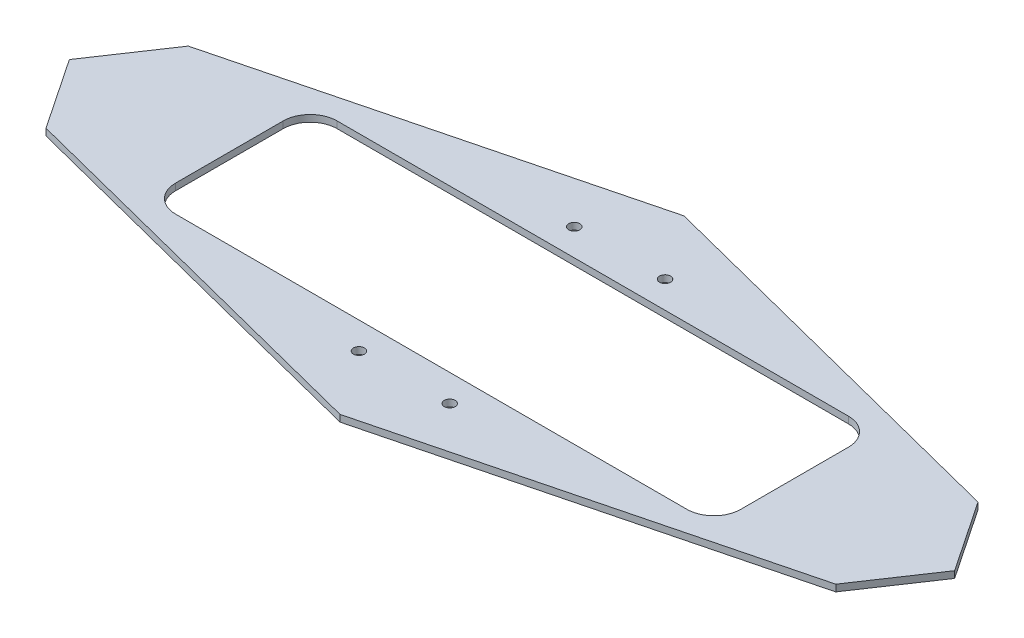
ISO-10303-21;
HEADER;
FILE_DESCRIPTION(('STEP AP214'),'2;1');
FILE_NAME('part.step','',(''),(''),'','','');
FILE_SCHEMA(('AUTOMOTIVE_DESIGN { 1 0 10303 214 1 1 1 1 }'));
ENDSEC;
DATA;
#1=APPLICATION_CONTEXT('core data for automotive mechanical design processes');
#2=APPLICATION_PROTOCOL_DEFINITION('international standard','automotive_design',2000,#1);
#3=PRODUCT_CONTEXT('',#1,'mechanical');
#4=PRODUCT('Part','Part','',(#3));
#5=PRODUCT_RELATED_PRODUCT_CATEGORY('part','',(#4));
#6=PRODUCT_DEFINITION_FORMATION('','',#4);
#7=PRODUCT_DEFINITION_CONTEXT('part definition',#1,'design');
#8=PRODUCT_DEFINITION('design','',#6,#7);
#9=PRODUCT_DEFINITION_SHAPE('','',#8);
#10=(LENGTH_UNIT() NAMED_UNIT(*) SI_UNIT(.MILLI.,.METRE.));
#11=(NAMED_UNIT(*) PLANE_ANGLE_UNIT() SI_UNIT($,.RADIAN.));
#12=(NAMED_UNIT(*) SI_UNIT($,.STERADIAN.) SOLID_ANGLE_UNIT());
#13=UNCERTAINTY_MEASURE_WITH_UNIT(LENGTH_MEASURE(1.E-05),#10,'distance_accuracy_value','');
#14=(GEOMETRIC_REPRESENTATION_CONTEXT(3) GLOBAL_UNCERTAINTY_ASSIGNED_CONTEXT((#13)) GLOBAL_UNIT_ASSIGNED_CONTEXT((#10,
#11,#12)) REPRESENTATION_CONTEXT('',''));
#15=CARTESIAN_POINT('',(0.,0.,0.));
#16=DIRECTION('',(0.,0.,1.));
#17=DIRECTION('',(1.,0.,0.));
#18=AXIS2_PLACEMENT_3D('',#15,#16,#17);
#19=CARTESIAN_POINT('',(-417.779308922507,3.175,0.));
#20=DIRECTION('',(0.830136035999272,0.,0.557560904059293));
#21=DIRECTION('',(0.557560904059293,0.,-0.830136035999272));
#22=AXIS2_PLACEMENT_3D('',#19,#20,#21);
#23=PLANE('',#22);
#24=DIRECTION('',(-0.557560904059293,0.,0.830136035999272));
#25=VECTOR('',#24,1.);
#26=CARTESIAN_POINT('',(-417.779308922507,-3.175,0.));
#27=LINE('',#26,#25);
#28=CARTESIAN_POINT('',(-372.691935384948,-3.175,-67.1292647486396));
#29=VERTEX_POINT('',#28);
#30=CARTESIAN_POINT('',(-417.779308922507,-3.175,0.));
#31=VERTEX_POINT('',#30);
#32=EDGE_CURVE('E204',#29,#31,#27,.T.);
#33=ORIENTED_EDGE('',*,*,#32,.T.);
#34=DIRECTION('',(0.,-1.,0.));
#35=VECTOR('',#34,1.);
#36=CARTESIAN_POINT('',(-417.779308922507,3.175,0.));
#37=LINE('',#36,#35);
#38=CARTESIAN_POINT('',(-417.779308922507,3.175,0.));
#39=VERTEX_POINT('',#38);
#40=EDGE_CURVE('E11',#39,#31,#37,.T.);
#41=ORIENTED_EDGE('',*,*,#40,.F.);
#42=DIRECTION('',(-0.557560904059293,0.,0.830136035999272));
#43=VECTOR('',#42,1.);
#44=CARTESIAN_POINT('',(-417.779308922507,3.175,0.));
#45=LINE('',#44,#43);
#46=CARTESIAN_POINT('',(-372.691935384948,3.175,-67.1292647486396));
#47=VERTEX_POINT('',#46);
#48=EDGE_CURVE('E215',#47,#39,#45,.T.);
#49=ORIENTED_EDGE('',*,*,#48,.F.);
#50=DIRECTION('',(0.,-1.,0.));
#51=VECTOR('',#50,1.);
#52=CARTESIAN_POINT('',(-372.691935384948,3.175,-67.1292647486396));
#53=LINE('',#52,#51);
#54=EDGE_CURVE('E233',#47,#29,#53,.T.);
#55=ORIENTED_EDGE('',*,*,#54,.T.);
#56=EDGE_LOOP('',(#33,#41,#49,#55));
#57=FACE_BOUND('',#56,.T.);
#58=ADVANCED_FACE('F33',(#57),#23,.F.);
#59=CARTESIAN_POINT('',(-417.779308922507,3.175,0.));
#60=DIRECTION('',(0.830136035999272,0.,-0.557560904059293));
#61=DIRECTION('',(-0.557560904059293,0.,-0.830136035999272));
#62=AXIS2_PLACEMENT_3D('',#59,#60,#61);
#63=PLANE('',#62);
#64=DIRECTION('',(0.557560904059293,0.,0.830136035999272));
#65=VECTOR('',#64,1.);
#66=CARTESIAN_POINT('',(-417.779308922507,-3.175,0.));
#67=LINE('',#66,#65);
#68=CARTESIAN_POINT('',(-372.691935384948,-3.175,67.1292647486397));
#69=VERTEX_POINT('',#68);
#70=EDGE_CURVE('E236',#31,#69,#67,.T.);
#71=ORIENTED_EDGE('',*,*,#70,.T.);
#72=DIRECTION('',(0.,-1.,0.));
#73=VECTOR('',#72,1.);
#74=CARTESIAN_POINT('',(-372.691935384948,3.175,67.1292647486397));
#75=LINE('',#74,#73);
#76=CARTESIAN_POINT('',(-372.691935384948,3.175,67.1292647486397));
#77=VERTEX_POINT('',#76);
#78=EDGE_CURVE('E40',#77,#69,#75,.T.);
#79=ORIENTED_EDGE('',*,*,#78,.F.);
#80=DIRECTION('',(0.557560904059293,0.,0.830136035999272));
#81=VECTOR('',#80,1.);
#82=CARTESIAN_POINT('',(-417.779308922507,3.175,0.));
#83=LINE('',#82,#81);
#84=EDGE_CURVE('E218',#39,#77,#83,.T.);
#85=ORIENTED_EDGE('',*,*,#84,.F.);
#86=ORIENTED_EDGE('',*,*,#40,.T.);
#87=EDGE_LOOP('',(#71,#79,#85,#86));
#88=FACE_BOUND('',#87,.T.);
#89=ADVANCED_FACE('F291',(#88),#63,.F.);
#90=CARTESIAN_POINT('',(0.,3.175,162.283527595768));
#91=DIRECTION('',(0.247380499716696,0.,-0.968918411611585));
#92=DIRECTION('',(-0.968918411611586,0.,-0.247380499716696));
#93=AXIS2_PLACEMENT_3D('',#90,#91,#92);
#94=PLANE('',#93);
#95=DIRECTION('',(0.968918411611585,0.,0.247380499716696));
#96=VECTOR('',#95,1.);
#97=CARTESIAN_POINT('',(0.,-3.175,162.283527595768));
#98=LINE('',#97,#96);
#99=CARTESIAN_POINT('',(0.,-3.175,162.283527595768));
#100=VERTEX_POINT('',#99);
#101=EDGE_CURVE('E238',#69,#100,#98,.T.);
#102=ORIENTED_EDGE('',*,*,#101,.T.);
#103=DIRECTION('',(0.,-1.,0.));
#104=VECTOR('',#103,1.);
#105=CARTESIAN_POINT('',(0.,3.175,162.283527595768));
#106=LINE('',#105,#104);
#107=CARTESIAN_POINT('',(0.,3.175,162.283527595768));
#108=VERTEX_POINT('',#107);
#109=EDGE_CURVE('E263',#108,#100,#106,.T.);
#110=ORIENTED_EDGE('',*,*,#109,.F.);
#111=DIRECTION('',(0.968918411611585,0.,0.247380499716696));
#112=VECTOR('',#111,1.);
#113=CARTESIAN_POINT('',(0.,3.175,162.283527595768));
#114=LINE('',#113,#112);
#115=EDGE_CURVE('E221',#77,#108,#114,.T.);
#116=ORIENTED_EDGE('',*,*,#115,.F.);
#117=ORIENTED_EDGE('',*,*,#78,.T.);
#118=EDGE_LOOP('',(#102,#110,#116,#117));
#119=FACE_BOUND('',#118,.T.);
#120=ADVANCED_FACE('F270',(#119),#94,.F.);
#121=CARTESIAN_POINT('',(372.691935384949,3.175,67.1292647486396));
#122=DIRECTION('',(-0.247380499716696,0.,-0.968918411611585));
#123=DIRECTION('',(-0.968918411611586,0.,0.247380499716696));
#124=AXIS2_PLACEMENT_3D('',#121,#122,#123);
#125=PLANE('',#124);
#126=DIRECTION('',(0.968918411611585,0.,-0.247380499716696));
#127=VECTOR('',#126,1.);
#128=CARTESIAN_POINT('',(372.691935384949,-3.175,67.1292647486396));
#129=LINE('',#128,#127);
#130=CARTESIAN_POINT('',(372.691935384949,-3.175,67.1292647486396));
#131=VERTEX_POINT('',#130);
#132=EDGE_CURVE('E240',#100,#131,#129,.T.);
#133=ORIENTED_EDGE('',*,*,#132,.T.);
#134=DIRECTION('',(0.,-1.,0.));
#135=VECTOR('',#134,1.);
#136=CARTESIAN_POINT('',(372.691935384949,3.175,67.1292647486396));
#137=LINE('',#136,#135);
#138=CARTESIAN_POINT('',(372.691935384949,3.175,67.1292647486396));
#139=VERTEX_POINT('',#138);
#140=EDGE_CURVE('E260',#139,#131,#137,.T.);
#141=ORIENTED_EDGE('',*,*,#140,.F.);
#142=DIRECTION('',(0.968918411611585,0.,-0.247380499716696));
#143=VECTOR('',#142,1.);
#144=CARTESIAN_POINT('',(372.691935384949,3.175,67.1292647486396));
#145=LINE('',#144,#143);
#146=EDGE_CURVE('E223',#108,#139,#145,.T.);
#147=ORIENTED_EDGE('',*,*,#146,.F.);
#148=ORIENTED_EDGE('',*,*,#109,.T.);
#149=EDGE_LOOP('',(#133,#141,#147,#148));
#150=FACE_BOUND('',#149,.T.);
#151=ADVANCED_FACE('F281',(#150),#125,.F.);
#152=CARTESIAN_POINT('',(417.779308922507,3.175,0.));
#153=DIRECTION('',(-0.830136035999272,0.,-0.557560904059292));
#154=DIRECTION('',(-0.557560904059292,0.,0.830136035999272));
#155=AXIS2_PLACEMENT_3D('',#152,#153,#154);
#156=PLANE('',#155);
#157=DIRECTION('',(0.557560904059292,0.,-0.830136035999272));
#158=VECTOR('',#157,1.);
#159=CARTESIAN_POINT('',(417.779308922507,-3.175,0.));
#160=LINE('',#159,#158);
#161=CARTESIAN_POINT('',(417.779308922507,-3.175,0.));
#162=VERTEX_POINT('',#161);
#163=EDGE_CURVE('E242',#131,#162,#160,.T.);
#164=ORIENTED_EDGE('',*,*,#163,.T.);
#165=DIRECTION('',(0.,-1.,0.));
#166=VECTOR('',#165,1.);
#167=CARTESIAN_POINT('',(417.779308922507,3.175,0.));
#168=LINE('',#167,#166);
#169=CARTESIAN_POINT('',(417.779308922507,3.175,0.));
#170=VERTEX_POINT('',#169);
#171=EDGE_CURVE('E257',#170,#162,#168,.T.);
#172=ORIENTED_EDGE('',*,*,#171,.F.);
#173=DIRECTION('',(0.557560904059292,0.,-0.830136035999272));
#174=VECTOR('',#173,1.);
#175=CARTESIAN_POINT('',(417.779308922507,3.175,0.));
#176=LINE('',#175,#174);
#177=EDGE_CURVE('E225',#139,#170,#176,.T.);
#178=ORIENTED_EDGE('',*,*,#177,.F.);
#179=ORIENTED_EDGE('',*,*,#140,.T.);
#180=EDGE_LOOP('',(#164,#172,#178,#179));
#181=FACE_BOUND('',#180,.T.);
#182=ADVANCED_FACE('F285',(#181),#156,.F.);
#183=CARTESIAN_POINT('',(372.691935384949,3.175,-67.1292647486396));
#184=DIRECTION('',(-0.830136035999272,0.,0.557560904059292));
#185=DIRECTION('',(0.557560904059292,0.,0.830136035999272));
#186=AXIS2_PLACEMENT_3D('',#183,#184,#185);
#187=PLANE('',#186);
#188=DIRECTION('',(-0.557560904059292,0.,-0.830136035999272));
#189=VECTOR('',#188,1.);
#190=CARTESIAN_POINT('',(372.691935384949,-3.175,-67.1292647486396));
#191=LINE('',#190,#189);
#192=CARTESIAN_POINT('',(372.691935384949,-3.175,-67.1292647486396));
#193=VERTEX_POINT('',#192);
#194=EDGE_CURVE('E244',#162,#193,#191,.T.);
#195=ORIENTED_EDGE('',*,*,#194,.T.);
#196=DIRECTION('',(0.,-1.,0.));
#197=VECTOR('',#196,1.);
#198=CARTESIAN_POINT('',(372.691935384949,3.175,-67.1292647486396));
#199=LINE('',#198,#197);
#200=CARTESIAN_POINT('',(372.691935384949,3.175,-67.1292647486396));
#201=VERTEX_POINT('',#200);
#202=EDGE_CURVE('E254',#201,#193,#199,.T.);
#203=ORIENTED_EDGE('',*,*,#202,.F.);
#204=DIRECTION('',(-0.557560904059292,0.,-0.830136035999272));
#205=VECTOR('',#204,1.);
#206=CARTESIAN_POINT('',(372.691935384949,3.175,-67.1292647486396));
#207=LINE('',#206,#205);
#208=EDGE_CURVE('E227',#170,#201,#207,.T.);
#209=ORIENTED_EDGE('',*,*,#208,.F.);
#210=ORIENTED_EDGE('',*,*,#171,.T.);
#211=EDGE_LOOP('',(#195,#203,#209,#210));
#212=FACE_BOUND('',#211,.T.);
#213=ADVANCED_FACE('F304',(#212),#187,.F.);
#214=CARTESIAN_POINT('',(0.,3.175,-162.283527595768));
#215=DIRECTION('',(-0.247380499716696,0.,0.968918411611585));
#216=DIRECTION('',(0.968918411611586,0.,0.247380499716696));
#217=AXIS2_PLACEMENT_3D('',#214,#215,#216);
#218=PLANE('',#217);
#219=DIRECTION('',(-0.968918411611585,0.,-0.247380499716696));
#220=VECTOR('',#219,1.);
#221=CARTESIAN_POINT('',(0.,-3.175,-162.283527595768));
#222=LINE('',#221,#220);
#223=CARTESIAN_POINT('',(0.,-3.175,-162.283527595768));
#224=VERTEX_POINT('',#223);
#225=EDGE_CURVE('E246',#193,#224,#222,.T.);
#226=ORIENTED_EDGE('',*,*,#225,.T.);
#227=DIRECTION('',(0.,-1.,0.));
#228=VECTOR('',#227,1.);
#229=CARTESIAN_POINT('',(0.,3.175,-162.283527595768));
#230=LINE('',#229,#228);
#231=CARTESIAN_POINT('',(0.,3.175,-162.283527595768));
#232=VERTEX_POINT('',#231);
#233=EDGE_CURVE('E251',#232,#224,#230,.T.);
#234=ORIENTED_EDGE('',*,*,#233,.F.);
#235=DIRECTION('',(-0.968918411611585,0.,-0.247380499716696));
#236=VECTOR('',#235,1.);
#237=CARTESIAN_POINT('',(0.,3.175,-162.283527595768));
#238=LINE('',#237,#236);
#239=EDGE_CURVE('E229',#201,#232,#238,.T.);
#240=ORIENTED_EDGE('',*,*,#239,.F.);
#241=ORIENTED_EDGE('',*,*,#202,.T.);
#242=EDGE_LOOP('',(#226,#234,#240,#241));
#243=FACE_BOUND('',#242,.T.);
#244=ADVANCED_FACE('F302',(#243),#218,.F.);
#245=CARTESIAN_POINT('',(-372.691935384948,3.175,-67.1292647486396));
#246=DIRECTION('',(0.247380499716696,0.,0.968918411611585));
#247=DIRECTION('',(0.968918411611586,0.,-0.247380499716696));
#248=AXIS2_PLACEMENT_3D('',#245,#246,#247);
#249=PLANE('',#248);
#250=DIRECTION('',(-0.968918411611585,0.,0.247380499716696));
#251=VECTOR('',#250,1.);
#252=CARTESIAN_POINT('',(-372.691935384948,-3.175,-67.1292647486396));
#253=LINE('',#252,#251);
#254=EDGE_CURVE('E219',#224,#29,#253,.T.);
#255=ORIENTED_EDGE('',*,*,#254,.T.);
#256=ORIENTED_EDGE('',*,*,#54,.F.);
#257=DIRECTION('',(-0.968918411611585,0.,0.247380499716696));
#258=VECTOR('',#257,1.);
#259=CARTESIAN_POINT('',(-372.691935384948,3.175,-67.1292647486396));
#260=LINE('',#259,#258);
#261=EDGE_CURVE('E231',#232,#47,#260,.T.);
#262=ORIENTED_EDGE('',*,*,#261,.F.);
#263=ORIENTED_EDGE('',*,*,#233,.T.);
#264=EDGE_LOOP('',(#255,#256,#262,#263));
#265=FACE_BOUND('',#264,.T.);
#266=ADVANCED_FACE('F297',(#265),#249,.F.);
#267=CARTESIAN_POINT('',(0.,3.175,0.));
#268=DIRECTION('',(0.,-1.,0.));
#269=DIRECTION('',(0.,0.,-1.));
#270=AXIS2_PLACEMENT_3D('',#267,#268,#269);
#271=PLANE('',#270);
#272=CARTESIAN_POINT('',(-42.8625,3.175,-101.6));
#273=DIRECTION('',(0.,1.,0.));
#274=DIRECTION('',(0.,0.,1.));
#275=AXIS2_PLACEMENT_3D('',#272,#273,#274);
#276=CIRCLE('',#275,5.159375);
#277=CARTESIAN_POINT('',(-42.8625,3.175,-96.440625));
#278=VERTEX_POINT('',#277);
#279=EDGE_CURVE('E492',#278,#278,#276,.T.);
#280=ORIENTED_EDGE('',*,*,#279,.F.);
#281=EDGE_LOOP('',(#280));
#282=FACE_BOUND('',#281,.T.);
#283=CARTESIAN_POINT('',(42.8625,3.175,-101.6));
#284=DIRECTION('',(0.,1.,0.));
#285=DIRECTION('',(0.,0.,1.));
#286=AXIS2_PLACEMENT_3D('',#283,#284,#285);
#287=CIRCLE('',#286,5.159375);
#288=CARTESIAN_POINT('',(42.8625,3.175,-96.440625));
#289=VERTEX_POINT('',#288);
#290=EDGE_CURVE('E497',#289,#289,#287,.T.);
#291=ORIENTED_EDGE('',*,*,#290,.F.);
#292=EDGE_LOOP('',(#291));
#293=FACE_BOUND('',#292,.T.);
#294=CARTESIAN_POINT('',(-42.8624999999999,3.175,101.6));
#295=DIRECTION('',(0.,1.,0.));
#296=DIRECTION('',(0.,0.,-1.));
#297=AXIS2_PLACEMENT_3D('',#294,#295,#296);
#298=CIRCLE('',#297,5.159375);
#299=CARTESIAN_POINT('',(-42.8624999999999,3.175,96.440625));
#300=VERTEX_POINT('',#299);
#301=EDGE_CURVE('E503',#300,#300,#298,.T.);
#302=ORIENTED_EDGE('',*,*,#301,.F.);
#303=EDGE_LOOP('',(#302));
#304=FACE_BOUND('',#303,.T.);
#305=CARTESIAN_POINT('',(42.8625,3.175,101.6));
#306=DIRECTION('',(0.,1.,0.));
#307=DIRECTION('',(0.,0.,-1.));
#308=AXIS2_PLACEMENT_3D('',#305,#306,#307);
#309=CIRCLE('',#308,5.159375);
#310=CARTESIAN_POINT('',(42.8625,3.175,96.440625));
#311=VERTEX_POINT('',#310);
#312=EDGE_CURVE('E509',#311,#311,#309,.T.);
#313=ORIENTED_EDGE('',*,*,#312,.F.);
#314=EDGE_LOOP('',(#313));
#315=FACE_BOUND('',#314,.T.);
#316=DIRECTION('',(0.,0.,-1.));
#317=VECTOR('',#316,1.);
#318=CARTESIAN_POINT('',(266.7,3.175,-50.8));
#319=LINE('',#318,#317);
#320=CARTESIAN_POINT('',(266.7,3.175,50.8));
#321=VERTEX_POINT('',#320);
#322=CARTESIAN_POINT('',(266.7,3.175,-50.8));
#323=VERTEX_POINT('',#322);
#324=EDGE_CURVE('E156',#321,#323,#319,.T.);
#325=ORIENTED_EDGE('',*,*,#324,.F.);
#326=CARTESIAN_POINT('',(241.3,3.175,50.8));
#327=DIRECTION('',(0.,1.,0.));
#328=DIRECTION('',(0.,0.,-1.));
#329=AXIS2_PLACEMENT_3D('',#326,#327,#328);
#330=CIRCLE('',#329,25.4);
#331=CARTESIAN_POINT('',(241.3,3.175,76.2));
#332=VERTEX_POINT('',#331);
#333=EDGE_CURVE('E47',#332,#321,#330,.T.);
#334=ORIENTED_EDGE('',*,*,#333,.F.);
#335=DIRECTION('',(1.,0.,0.));
#336=VECTOR('',#335,1.);
#337=CARTESIAN_POINT('',(241.3,3.175,76.2));
#338=LINE('',#337,#336);
#339=CARTESIAN_POINT('',(-241.3,3.175,76.2));
#340=VERTEX_POINT('',#339);
#341=EDGE_CURVE('E178',#340,#332,#338,.T.);
#342=ORIENTED_EDGE('',*,*,#341,.F.);
#343=CARTESIAN_POINT('',(-241.3,3.175,50.8));
#344=DIRECTION('',(0.,1.,0.));
#345=DIRECTION('',(0.,0.,-1.));
#346=AXIS2_PLACEMENT_3D('',#343,#344,#345);
#347=CIRCLE('',#346,25.4);
#348=CARTESIAN_POINT('',(-266.7,3.175,50.8));
#349=VERTEX_POINT('',#348);
#350=EDGE_CURVE('E175',#349,#340,#347,.T.);
#351=ORIENTED_EDGE('',*,*,#350,.F.);
#352=DIRECTION('',(0.,0.,1.));
#353=VECTOR('',#352,1.);
#354=CARTESIAN_POINT('',(-266.7,3.175,-50.8));
#355=LINE('',#354,#353);
#356=CARTESIAN_POINT('',(-266.7,3.175,-50.8));
#357=VERTEX_POINT('',#356);
#358=EDGE_CURVE('E172',#357,#349,#355,.T.);
#359=ORIENTED_EDGE('',*,*,#358,.F.);
#360=CARTESIAN_POINT('',(-241.3,3.175,-50.8));
#361=DIRECTION('',(0.,1.,0.));
#362=DIRECTION('',(0.,0.,1.));
#363=AXIS2_PLACEMENT_3D('',#360,#361,#362);
#364=CIRCLE('',#363,25.4);
#365=CARTESIAN_POINT('',(-241.3,3.175,-76.2));
#366=VERTEX_POINT('',#365);
#367=EDGE_CURVE('E166',#366,#357,#364,.T.);
#368=ORIENTED_EDGE('',*,*,#367,.F.);
#369=DIRECTION('',(-1.,0.,0.));
#370=VECTOR('',#369,1.);
#371=CARTESIAN_POINT('',(241.3,3.175,-76.2));
#372=LINE('',#371,#370);
#373=CARTESIAN_POINT('',(241.3,3.175,-76.2));
#374=VERTEX_POINT('',#373);
#375=EDGE_CURVE('E164',#374,#366,#372,.T.);
#376=ORIENTED_EDGE('',*,*,#375,.F.);
#377=CARTESIAN_POINT('',(241.3,3.175,-50.8));
#378=DIRECTION('',(0.,1.,0.));
#379=DIRECTION('',(0.,0.,-1.));
#380=AXIS2_PLACEMENT_3D('',#377,#378,#379);
#381=CIRCLE('',#380,25.4);
#382=EDGE_CURVE('E147',#323,#374,#381,.T.);
#383=ORIENTED_EDGE('',*,*,#382,.F.);
#384=EDGE_LOOP('',(#325,#334,#342,#351,#359,#368,#376,#383));
#385=FACE_BOUND('',#384,.T.);
#386=ORIENTED_EDGE('',*,*,#48,.T.);
#387=ORIENTED_EDGE('',*,*,#84,.T.);
#388=ORIENTED_EDGE('',*,*,#115,.T.);
#389=ORIENTED_EDGE('',*,*,#146,.T.);
#390=ORIENTED_EDGE('',*,*,#177,.T.);
#391=ORIENTED_EDGE('',*,*,#208,.T.);
#392=ORIENTED_EDGE('',*,*,#239,.T.);
#393=ORIENTED_EDGE('',*,*,#261,.T.);
#394=EDGE_LOOP('',(#386,#387,#388,#389,#390,#391,#392,#393));
#395=FACE_BOUND('',#394,.T.);
#396=ADVANCED_FACE('F160',(#282,#293,#304,#315,#385,#395),#271,.F.);
#397=CARTESIAN_POINT('',(0.,-3.175,0.));
#398=DIRECTION('',(0.,-1.,0.));
#399=DIRECTION('',(0.,0.,-1.));
#400=AXIS2_PLACEMENT_3D('',#397,#398,#399);
#401=PLANE('',#400);
#402=CARTESIAN_POINT('',(-42.8625,-3.175,-101.6));
#403=DIRECTION('',(0.,1.,0.));
#404=DIRECTION('',(0.,0.,1.));
#405=AXIS2_PLACEMENT_3D('',#402,#403,#404);
#406=CIRCLE('',#405,5.159375);
#407=CARTESIAN_POINT('',(-42.8625,-3.175,-96.440625));
#408=VERTEX_POINT('',#407);
#409=EDGE_CURVE('E489',#408,#408,#406,.T.);
#410=ORIENTED_EDGE('',*,*,#409,.T.);
#411=EDGE_LOOP('',(#410));
#412=FACE_BOUND('',#411,.T.);
#413=CARTESIAN_POINT('',(42.8625,-3.175,-101.6));
#414=DIRECTION('',(0.,1.,0.));
#415=DIRECTION('',(0.,0.,1.));
#416=AXIS2_PLACEMENT_3D('',#413,#414,#415);
#417=CIRCLE('',#416,5.159375);
#418=CARTESIAN_POINT('',(42.8625,-3.175,-96.440625));
#419=VERTEX_POINT('',#418);
#420=EDGE_CURVE('E493',#419,#419,#417,.T.);
#421=ORIENTED_EDGE('',*,*,#420,.T.);
#422=EDGE_LOOP('',(#421));
#423=FACE_BOUND('',#422,.T.);
#424=CARTESIAN_POINT('',(-42.8624999999999,-3.175,101.6));
#425=DIRECTION('',(0.,1.,0.));
#426=DIRECTION('',(0.,0.,-1.));
#427=AXIS2_PLACEMENT_3D('',#424,#425,#426);
#428=CIRCLE('',#427,5.159375);
#429=CARTESIAN_POINT('',(-42.8624999999999,-3.175,96.440625));
#430=VERTEX_POINT('',#429);
#431=EDGE_CURVE('E501',#430,#430,#428,.T.);
#432=ORIENTED_EDGE('',*,*,#431,.T.);
#433=EDGE_LOOP('',(#432));
#434=FACE_BOUND('',#433,.T.);
#435=CARTESIAN_POINT('',(42.8625,-3.175,101.6));
#436=DIRECTION('',(0.,1.,0.));
#437=DIRECTION('',(0.,0.,-1.));
#438=AXIS2_PLACEMENT_3D('',#435,#436,#437);
#439=CIRCLE('',#438,5.159375);
#440=CARTESIAN_POINT('',(42.8625,-3.175,96.440625));
#441=VERTEX_POINT('',#440);
#442=EDGE_CURVE('E506',#441,#441,#439,.T.);
#443=ORIENTED_EDGE('',*,*,#442,.T.);
#444=EDGE_LOOP('',(#443));
#445=FACE_BOUND('',#444,.T.);
#446=CARTESIAN_POINT('',(241.3,-3.175,50.8));
#447=DIRECTION('',(0.,1.,0.));
#448=DIRECTION('',(0.,0.,-1.));
#449=AXIS2_PLACEMENT_3D('',#446,#447,#448);
#450=CIRCLE('',#449,25.4);
#451=CARTESIAN_POINT('',(241.3,-3.175,76.2));
#452=VERTEX_POINT('',#451);
#453=CARTESIAN_POINT('',(266.7,-3.175,50.8));
#454=VERTEX_POINT('',#453);
#455=EDGE_CURVE('E181',#452,#454,#450,.T.);
#456=ORIENTED_EDGE('',*,*,#455,.T.);
#457=DIRECTION('',(0.,0.,-1.));
#458=VECTOR('',#457,1.);
#459=CARTESIAN_POINT('',(266.7,-3.175,-50.8));
#460=LINE('',#459,#458);
#461=CARTESIAN_POINT('',(266.7,-3.175,-50.8));
#462=VERTEX_POINT('',#461);
#463=EDGE_CURVE('E184',#454,#462,#460,.T.);
#464=ORIENTED_EDGE('',*,*,#463,.T.);
#465=CARTESIAN_POINT('',(241.3,-3.175,-50.8));
#466=DIRECTION('',(0.,1.,0.));
#467=DIRECTION('',(0.,0.,-1.));
#468=AXIS2_PLACEMENT_3D('',#465,#466,#467);
#469=CIRCLE('',#468,25.4);
#470=CARTESIAN_POINT('',(241.3,-3.175,-76.2));
#471=VERTEX_POINT('',#470);
#472=EDGE_CURVE('E55',#462,#471,#469,.T.);
#473=ORIENTED_EDGE('',*,*,#472,.T.);
#474=DIRECTION('',(-1.,0.,0.));
#475=VECTOR('',#474,1.);
#476=CARTESIAN_POINT('',(241.3,-3.175,-76.2));
#477=LINE('',#476,#475);
#478=CARTESIAN_POINT('',(-241.3,-3.175,-76.2));
#479=VERTEX_POINT('',#478);
#480=EDGE_CURVE('E187',#471,#479,#477,.T.);
#481=ORIENTED_EDGE('',*,*,#480,.T.);
#482=CARTESIAN_POINT('',(-241.3,-3.175,-50.8));
#483=DIRECTION('',(0.,1.,0.));
#484=DIRECTION('',(0.,0.,1.));
#485=AXIS2_PLACEMENT_3D('',#482,#483,#484);
#486=CIRCLE('',#485,25.4);
#487=CARTESIAN_POINT('',(-266.7,-3.175,-50.8));
#488=VERTEX_POINT('',#487);
#489=EDGE_CURVE('E190',#479,#488,#486,.T.);
#490=ORIENTED_EDGE('',*,*,#489,.T.);
#491=DIRECTION('',(0.,0.,1.));
#492=VECTOR('',#491,1.);
#493=CARTESIAN_POINT('',(-266.7,-3.175,-50.8));
#494=LINE('',#493,#492);
#495=CARTESIAN_POINT('',(-266.7,-3.175,50.8));
#496=VERTEX_POINT('',#495);
#497=EDGE_CURVE('E193',#488,#496,#494,.T.);
#498=ORIENTED_EDGE('',*,*,#497,.T.);
#499=CARTESIAN_POINT('',(-241.3,-3.175,50.8));
#500=DIRECTION('',(0.,1.,0.));
#501=DIRECTION('',(0.,0.,-1.));
#502=AXIS2_PLACEMENT_3D('',#499,#500,#501);
#503=CIRCLE('',#502,25.4);
#504=CARTESIAN_POINT('',(-241.3,-3.175,76.2));
#505=VERTEX_POINT('',#504);
#506=EDGE_CURVE('E196',#496,#505,#503,.T.);
#507=ORIENTED_EDGE('',*,*,#506,.T.);
#508=DIRECTION('',(1.,0.,0.));
#509=VECTOR('',#508,1.);
#510=CARTESIAN_POINT('',(241.3,-3.175,76.2));
#511=LINE('',#510,#509);
#512=EDGE_CURVE('E199',#505,#452,#511,.T.);
#513=ORIENTED_EDGE('',*,*,#512,.T.);
#514=EDGE_LOOP('',(#456,#464,#473,#481,#490,#498,#507,#513));
#515=FACE_BOUND('',#514,.T.);
#516=ORIENTED_EDGE('',*,*,#32,.F.);
#517=ORIENTED_EDGE('',*,*,#254,.F.);
#518=ORIENTED_EDGE('',*,*,#225,.F.);
#519=ORIENTED_EDGE('',*,*,#194,.F.);
#520=ORIENTED_EDGE('',*,*,#163,.F.);
#521=ORIENTED_EDGE('',*,*,#132,.F.);
#522=ORIENTED_EDGE('',*,*,#101,.F.);
#523=ORIENTED_EDGE('',*,*,#70,.F.);
#524=EDGE_LOOP('',(#516,#517,#518,#519,#520,#521,#522,#523));
#525=FACE_BOUND('',#524,.T.);
#526=ADVANCED_FACE('F276',(#412,#423,#434,#445,#515,#525),#401,.T.);
#527=CARTESIAN_POINT('',(241.3,-3.175,50.8));
#528=DIRECTION('',(0.,1.,0.));
#529=DIRECTION('',(0.,0.,1.));
#530=AXIS2_PLACEMENT_3D('',#527,#528,#529);
#531=CYLINDRICAL_SURFACE('',#530,25.4);
#532=DIRECTION('',(0.,1.,0.));
#533=VECTOR('',#532,1.);
#534=CARTESIAN_POINT('',(266.7,-3.175,50.8));
#535=LINE('',#534,#533);
#536=EDGE_CURVE('E153',#454,#321,#535,.T.);
#537=ORIENTED_EDGE('',*,*,#536,.F.);
#538=ORIENTED_EDGE('',*,*,#455,.F.);
#539=DIRECTION('',(0.,1.,0.));
#540=VECTOR('',#539,1.);
#541=CARTESIAN_POINT('',(241.3,-3.175,76.2));
#542=LINE('',#541,#540);
#543=EDGE_CURVE('E202',#452,#332,#542,.T.);
#544=ORIENTED_EDGE('',*,*,#543,.T.);
#545=ORIENTED_EDGE('',*,*,#333,.T.);
#546=EDGE_LOOP('',(#537,#538,#544,#545));
#547=FACE_BOUND('',#546,.T.);
#548=ADVANCED_FACE('F367',(#547),#531,.F.);
#549=CARTESIAN_POINT('',(241.3,-3.175,76.2));
#550=DIRECTION('',(0.,0.,1.));
#551=DIRECTION('',(1.,0.,0.));
#552=AXIS2_PLACEMENT_3D('',#549,#550,#551);
#553=PLANE('',#552);
#554=ORIENTED_EDGE('',*,*,#543,.F.);
#555=ORIENTED_EDGE('',*,*,#512,.F.);
#556=DIRECTION('',(0.,1.,0.));
#557=VECTOR('',#556,1.);
#558=CARTESIAN_POINT('',(-241.3,-3.175,76.2));
#559=LINE('',#558,#557);
#560=EDGE_CURVE('E205',#505,#340,#559,.T.);
#561=ORIENTED_EDGE('',*,*,#560,.T.);
#562=ORIENTED_EDGE('',*,*,#341,.T.);
#563=EDGE_LOOP('',(#554,#555,#561,#562));
#564=FACE_BOUND('',#563,.T.);
#565=ADVANCED_FACE('F377',(#564),#553,.F.);
#566=CARTESIAN_POINT('',(-241.3,-3.175,50.8));
#567=DIRECTION('',(0.,1.,0.));
#568=DIRECTION('',(0.,0.,1.));
#569=AXIS2_PLACEMENT_3D('',#566,#567,#568);
#570=CYLINDRICAL_SURFACE('',#569,25.4);
#571=ORIENTED_EDGE('',*,*,#560,.F.);
#572=ORIENTED_EDGE('',*,*,#506,.F.);
#573=DIRECTION('',(0.,1.,0.));
#574=VECTOR('',#573,1.);
#575=CARTESIAN_POINT('',(-266.7,-3.175,50.8));
#576=LINE('',#575,#574);
#577=EDGE_CURVE('E207',#496,#349,#576,.T.);
#578=ORIENTED_EDGE('',*,*,#577,.T.);
#579=ORIENTED_EDGE('',*,*,#350,.T.);
#580=EDGE_LOOP('',(#571,#572,#578,#579));
#581=FACE_BOUND('',#580,.T.);
#582=ADVANCED_FACE('F386',(#581),#570,.F.);
#583=CARTESIAN_POINT('',(-266.7,-3.175,-50.8));
#584=DIRECTION('',(-1.,0.,0.));
#585=DIRECTION('',(0.,0.,1.));
#586=AXIS2_PLACEMENT_3D('',#583,#584,#585);
#587=PLANE('',#586);
#588=ORIENTED_EDGE('',*,*,#577,.F.);
#589=ORIENTED_EDGE('',*,*,#497,.F.);
#590=DIRECTION('',(0.,1.,0.));
#591=VECTOR('',#590,1.);
#592=CARTESIAN_POINT('',(-266.7,-3.175,-50.8));
#593=LINE('',#592,#591);
#594=EDGE_CURVE('E209',#488,#357,#593,.T.);
#595=ORIENTED_EDGE('',*,*,#594,.T.);
#596=ORIENTED_EDGE('',*,*,#358,.T.);
#597=EDGE_LOOP('',(#588,#589,#595,#596));
#598=FACE_BOUND('',#597,.T.);
#599=ADVANCED_FACE('F396',(#598),#587,.F.);
#600=CARTESIAN_POINT('',(-241.3,-3.175,-50.8));
#601=DIRECTION('',(0.,1.,0.));
#602=DIRECTION('',(0.,0.,1.));
#603=AXIS2_PLACEMENT_3D('',#600,#601,#602);
#604=CYLINDRICAL_SURFACE('',#603,25.4);
#605=ORIENTED_EDGE('',*,*,#594,.F.);
#606=ORIENTED_EDGE('',*,*,#489,.F.);
#607=DIRECTION('',(0.,1.,0.));
#608=VECTOR('',#607,1.);
#609=CARTESIAN_POINT('',(-241.3,-3.175,-76.2));
#610=LINE('',#609,#608);
#611=EDGE_CURVE('E211',#479,#366,#610,.T.);
#612=ORIENTED_EDGE('',*,*,#611,.T.);
#613=ORIENTED_EDGE('',*,*,#367,.T.);
#614=EDGE_LOOP('',(#605,#606,#612,#613));
#615=FACE_BOUND('',#614,.T.);
#616=ADVANCED_FACE('F406',(#615),#604,.F.);
#617=CARTESIAN_POINT('',(241.3,-3.175,-76.2));
#618=DIRECTION('',(0.,0.,-1.));
#619=DIRECTION('',(-1.,0.,0.));
#620=AXIS2_PLACEMENT_3D('',#617,#618,#619);
#621=PLANE('',#620);
#622=ORIENTED_EDGE('',*,*,#611,.F.);
#623=ORIENTED_EDGE('',*,*,#480,.F.);
#624=DIRECTION('',(0.,1.,0.));
#625=VECTOR('',#624,1.);
#626=CARTESIAN_POINT('',(241.3,-3.175,-76.2));
#627=LINE('',#626,#625);
#628=EDGE_CURVE('E152',#471,#374,#627,.T.);
#629=ORIENTED_EDGE('',*,*,#628,.T.);
#630=ORIENTED_EDGE('',*,*,#375,.T.);
#631=EDGE_LOOP('',(#622,#623,#629,#630));
#632=FACE_BOUND('',#631,.T.);
#633=ADVANCED_FACE('F416',(#632),#621,.F.);
#634=CARTESIAN_POINT('',(241.3,-3.175,-50.8));
#635=DIRECTION('',(0.,1.,0.));
#636=DIRECTION('',(0.,0.,1.));
#637=AXIS2_PLACEMENT_3D('',#634,#635,#636);
#638=CYLINDRICAL_SURFACE('',#637,25.4);
#639=ORIENTED_EDGE('',*,*,#628,.F.);
#640=ORIENTED_EDGE('',*,*,#472,.F.);
#641=DIRECTION('',(0.,1.,0.));
#642=VECTOR('',#641,1.);
#643=CARTESIAN_POINT('',(266.7,-3.175,-50.8));
#644=LINE('',#643,#642);
#645=EDGE_CURVE('E143',#462,#323,#644,.T.);
#646=ORIENTED_EDGE('',*,*,#645,.T.);
#647=ORIENTED_EDGE('',*,*,#382,.T.);
#648=EDGE_LOOP('',(#639,#640,#646,#647));
#649=FACE_BOUND('',#648,.T.);
#650=ADVANCED_FACE('F145',(#649),#638,.F.);
#651=CARTESIAN_POINT('',(266.7,-3.175,-50.8));
#652=DIRECTION('',(1.,0.,0.));
#653=DIRECTION('',(0.,0.,-1.));
#654=AXIS2_PLACEMENT_3D('',#651,#652,#653);
#655=PLANE('',#654);
#656=ORIENTED_EDGE('',*,*,#645,.F.);
#657=ORIENTED_EDGE('',*,*,#463,.F.);
#658=ORIENTED_EDGE('',*,*,#536,.T.);
#659=ORIENTED_EDGE('',*,*,#324,.T.);
#660=EDGE_LOOP('',(#656,#657,#658,#659));
#661=FACE_BOUND('',#660,.T.);
#662=ADVANCED_FACE('F157',(#661),#655,.F.);
#663=CARTESIAN_POINT('',(42.8625,-3.175,101.6));
#664=DIRECTION('',(0.,1.,0.));
#665=DIRECTION('',(0.,0.,1.));
#666=AXIS2_PLACEMENT_3D('',#663,#664,#665);
#667=CYLINDRICAL_SURFACE('',#666,5.159375);
#668=ORIENTED_EDGE('',*,*,#442,.F.);
#669=EDGE_LOOP('',(#668));
#670=FACE_BOUND('',#669,.T.);
#671=ORIENTED_EDGE('',*,*,#312,.T.);
#672=EDGE_LOOP('',(#671));
#673=FACE_BOUND('',#672,.T.);
#674=ADVANCED_FACE('F443',(#670,#673),#667,.F.);
#675=CARTESIAN_POINT('',(-42.8624999999999,-3.175,101.6));
#676=DIRECTION('',(0.,1.,0.));
#677=DIRECTION('',(0.,0.,1.));
#678=AXIS2_PLACEMENT_3D('',#675,#676,#677);
#679=CYLINDRICAL_SURFACE('',#678,5.159375);
#680=ORIENTED_EDGE('',*,*,#431,.F.);
#681=EDGE_LOOP('',(#680));
#682=FACE_BOUND('',#681,.T.);
#683=ORIENTED_EDGE('',*,*,#301,.T.);
#684=EDGE_LOOP('',(#683));
#685=FACE_BOUND('',#684,.T.);
#686=ADVANCED_FACE('F452',(#682,#685),#679,.F.);
#687=CARTESIAN_POINT('',(42.8625,-3.175,-101.6));
#688=DIRECTION('',(0.,1.,0.));
#689=DIRECTION('',(0.,0.,1.));
#690=AXIS2_PLACEMENT_3D('',#687,#688,#689);
#691=CYLINDRICAL_SURFACE('',#690,5.159375);
#692=ORIENTED_EDGE('',*,*,#420,.F.);
#693=EDGE_LOOP('',(#692));
#694=FACE_BOUND('',#693,.T.);
#695=ORIENTED_EDGE('',*,*,#290,.T.);
#696=EDGE_LOOP('',(#695));
#697=FACE_BOUND('',#696,.T.);
#698=ADVANCED_FACE('F462',(#694,#697),#691,.F.);
#699=CARTESIAN_POINT('',(-42.8625,-3.175,-101.6));
#700=DIRECTION('',(0.,1.,0.));
#701=DIRECTION('',(0.,0.,1.));
#702=AXIS2_PLACEMENT_3D('',#699,#700,#701);
#703=CYLINDRICAL_SURFACE('',#702,5.159375);
#704=ORIENTED_EDGE('',*,*,#409,.F.);
#705=EDGE_LOOP('',(#704));
#706=FACE_BOUND('',#705,.T.);
#707=ORIENTED_EDGE('',*,*,#279,.T.);
#708=EDGE_LOOP('',(#707));
#709=FACE_BOUND('',#708,.T.);
#710=ADVANCED_FACE('F472',(#706,#709),#703,.F.);
#711=CLOSED_SHELL('',(#58,#89,#120,#151,#182,#213,#244,#266,#396,#526,#548,#565,#582,#599,#616,
#633,#650,#662,#674,#686,#698,#710));
#712=MANIFOLD_SOLID_BREP('B2',#711);
#713=ADVANCED_BREP_SHAPE_REPRESENTATION('',(#18,#712),#14);
#714=SHAPE_DEFINITION_REPRESENTATION(#9,#713);
ENDSEC;
END-ISO-10303-21;
